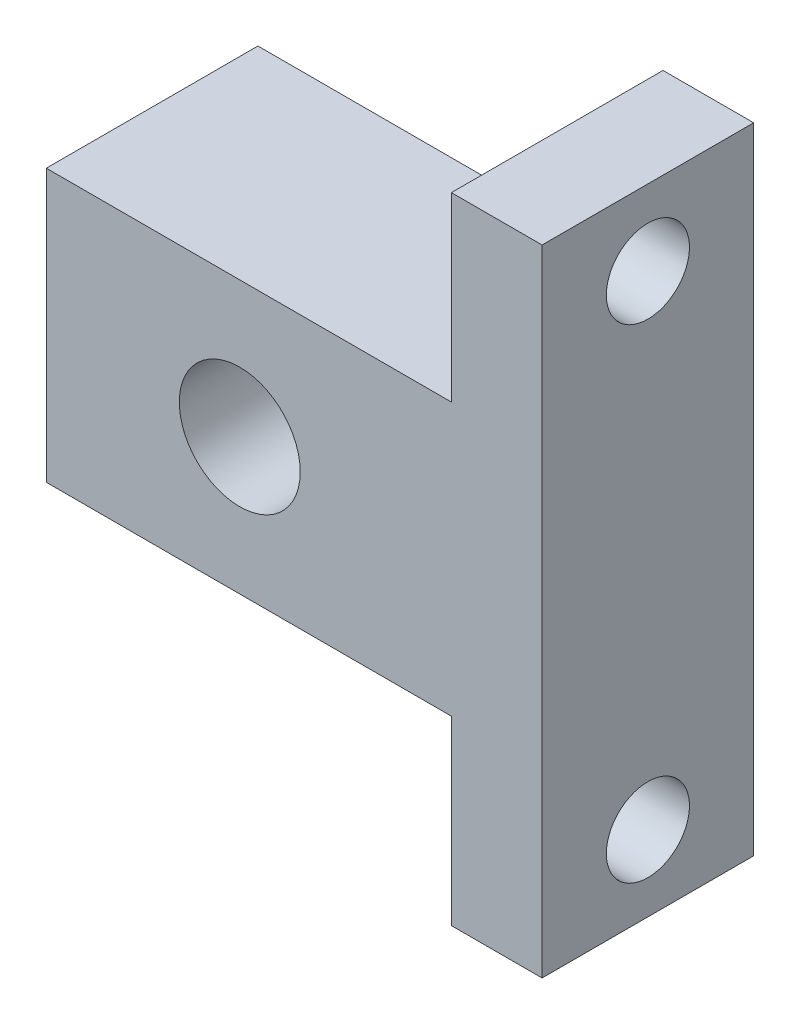
ISO-10303-21;
HEADER;
FILE_DESCRIPTION(('STEP AP214'),'2;1');
FILE_NAME('part.step','',(''),(''),'','','');
FILE_SCHEMA(('AUTOMOTIVE_DESIGN { 1 0 10303 214 1 1 1 1 }'));
ENDSEC;
DATA;
#1=APPLICATION_CONTEXT('core data for automotive mechanical design processes');
#2=APPLICATION_PROTOCOL_DEFINITION('international standard','automotive_design',2000,#1);
#3=PRODUCT_CONTEXT('',#1,'mechanical');
#4=PRODUCT('Part','Part','',(#3));
#5=PRODUCT_RELATED_PRODUCT_CATEGORY('part','',(#4));
#6=PRODUCT_DEFINITION_FORMATION('','',#4);
#7=PRODUCT_DEFINITION_CONTEXT('part definition',#1,'design');
#8=PRODUCT_DEFINITION('design','',#6,#7);
#9=PRODUCT_DEFINITION_SHAPE('','',#8);
#10=(LENGTH_UNIT() NAMED_UNIT(*) SI_UNIT(.MILLI.,.METRE.));
#11=(NAMED_UNIT(*) PLANE_ANGLE_UNIT() SI_UNIT($,.RADIAN.));
#12=(NAMED_UNIT(*) SI_UNIT($,.STERADIAN.) SOLID_ANGLE_UNIT());
#13=UNCERTAINTY_MEASURE_WITH_UNIT(LENGTH_MEASURE(1.E-05),#10,'distance_accuracy_value','');
#14=(GEOMETRIC_REPRESENTATION_CONTEXT(3) GLOBAL_UNCERTAINTY_ASSIGNED_CONTEXT((#13)) GLOBAL_UNIT_ASSIGNED_CONTEXT((#10,
#11,#12)) REPRESENTATION_CONTEXT('',''));
#15=CARTESIAN_POINT('',(0.,0.,0.));
#16=DIRECTION('',(0.,0.,1.));
#17=DIRECTION('',(1.,0.,0.));
#18=AXIS2_PLACEMENT_3D('',#15,#16,#17);
#19=CARTESIAN_POINT('',(20.,-16.0000002384186,7.00000010430813));
#20=DIRECTION('',(-1.,0.,0.));
#21=DIRECTION('',(0.,0.,1.));
#22=AXIS2_PLACEMENT_3D('',#19,#20,#21);
#23=CYLINDRICAL_SURFACE('',#22,2.75);
#24=CARTESIAN_POINT('',(14.0001,-16.0000002384186,7.00000010430813));
#25=DIRECTION('',(-1.,0.,0.));
#26=DIRECTION('',(0.,0.,1.));
#27=AXIS2_PLACEMENT_3D('',#24,#25,#26);
#28=CIRCLE('',#27,2.75);
#29=CARTESIAN_POINT('',(14.0001,-16.0000002384186,9.75000010430813));
#30=VERTEX_POINT('',#29);
#31=EDGE_CURVE('E20',#30,#30,#28,.F.);
#32=ORIENTED_EDGE('',*,*,#31,.F.);
#33=EDGE_LOOP('',(#32));
#34=FACE_BOUND('',#33,.T.);
#35=CARTESIAN_POINT('',(20.,-16.0000002384186,7.00000010430813));
#36=DIRECTION('',(-1.,0.,0.));
#37=DIRECTION('',(0.,0.,1.));
#38=AXIS2_PLACEMENT_3D('',#35,#36,#37);
#39=CIRCLE('',#38,2.75);
#40=CARTESIAN_POINT('',(20.,-16.0000002384186,9.75000010430813));
#41=VERTEX_POINT('',#40);
#42=EDGE_CURVE('E117',#41,#41,#39,.T.);
#43=ORIENTED_EDGE('',*,*,#42,.F.);
#44=EDGE_LOOP('',(#43));
#45=FACE_BOUND('',#44,.T.);
#46=ADVANCED_FACE('F17',(#34,#45),#23,.F.);
#47=CARTESIAN_POINT('',(20.,16.,7.00000010430813));
#48=DIRECTION('',(-1.,0.,0.));
#49=DIRECTION('',(0.,0.,1.));
#50=AXIS2_PLACEMENT_3D('',#47,#48,#49);
#51=CYLINDRICAL_SURFACE('',#50,2.75);
#52=CARTESIAN_POINT('',(14.0000000391155,16.,7.00000010430813));
#53=DIRECTION('',(-1.,0.,0.));
#54=DIRECTION('',(0.,0.,1.));
#55=AXIS2_PLACEMENT_3D('',#52,#53,#54);
#56=CIRCLE('',#55,2.75);
#57=CARTESIAN_POINT('',(14.0000000391155,16.,9.75000010430813));
#58=VERTEX_POINT('',#57);
#59=EDGE_CURVE('E112',#58,#58,#56,.F.);
#60=ORIENTED_EDGE('',*,*,#59,.F.);
#61=EDGE_LOOP('',(#60));
#62=FACE_BOUND('',#61,.T.);
#63=CARTESIAN_POINT('',(20.,16.,7.00000010430813));
#64=DIRECTION('',(-1.,0.,0.));
#65=DIRECTION('',(0.,0.,1.));
#66=AXIS2_PLACEMENT_3D('',#63,#64,#65);
#67=CIRCLE('',#66,2.75);
#68=CARTESIAN_POINT('',(20.,16.,9.75000010430813));
#69=VERTEX_POINT('',#68);
#70=EDGE_CURVE('E120',#69,#69,#67,.T.);
#71=ORIENTED_EDGE('',*,*,#70,.F.);
#72=EDGE_LOOP('',(#71));
#73=FACE_BOUND('',#72,.T.);
#74=ADVANCED_FACE('F149',(#62,#73),#51,.F.);
#75=CARTESIAN_POINT('',(3.6,0.,0.));
#76=DIRECTION('',(0.,0.,1.));
#77=DIRECTION('',(1.,0.,0.));
#78=AXIS2_PLACEMENT_3D('',#75,#76,#77);
#79=PLANE('',#78);
#80=CARTESIAN_POINT('',(0.,0.,0.));
#81=DIRECTION('',(0.,0.,1.));
#82=DIRECTION('',(1.,0.,0.));
#83=AXIS2_PLACEMENT_3D('',#80,#81,#82);
#84=CIRCLE('',#83,4.);
#85=CARTESIAN_POINT('',(4.,0.,0.));
#86=VERTEX_POINT('',#85);
#87=EDGE_CURVE('E108',#86,#86,#84,.T.);
#88=ORIENTED_EDGE('',*,*,#87,.T.);
#89=EDGE_LOOP('',(#88));
#90=FACE_BOUND('',#89,.T.);
#91=DIRECTION('',(1.,0.,0.));
#92=VECTOR('',#91,1.);
#93=CARTESIAN_POINT('',(14.0000002086163,9.,0.));
#94=LINE('',#93,#92);
#95=CARTESIAN_POINT('',(14.0000001043081,9.,0.));
#96=VERTEX_POINT('',#95);
#97=CARTESIAN_POINT('',(-12.8,9.,0.));
#98=VERTEX_POINT('',#97);
#99=EDGE_CURVE('E115',#96,#98,#94,.F.);
#100=ORIENTED_EDGE('',*,*,#99,.F.);
#101=DIRECTION('',(1.73846881335038E-08,-1.,0.));
#102=VECTOR('',#101,1.);
#103=CARTESIAN_POINT('',(14.,21.,0.));
#104=LINE('',#103,#102);
#105=CARTESIAN_POINT('',(14.,21.,0.));
#106=VERTEX_POINT('',#105);
#107=EDGE_CURVE('E185',#106,#96,#104,.T.);
#108=ORIENTED_EDGE('',*,*,#107,.F.);
#109=DIRECTION('',(1.,0.,0.));
#110=VECTOR('',#109,1.);
#111=CARTESIAN_POINT('',(20.,21.,0.));
#112=LINE('',#111,#110);
#113=CARTESIAN_POINT('',(20.,21.,0.));
#114=VERTEX_POINT('',#113);
#115=EDGE_CURVE('E119',#114,#106,#112,.F.);
#116=ORIENTED_EDGE('',*,*,#115,.F.);
#117=DIRECTION('',(0.,1.,0.));
#118=VECTOR('',#117,1.);
#119=CARTESIAN_POINT('',(20.,-21.,0.));
#120=LINE('',#119,#118);
#121=CARTESIAN_POINT('',(20.,-21.,0.));
#122=VERTEX_POINT('',#121);
#123=EDGE_CURVE('E126',#122,#114,#120,.T.);
#124=ORIENTED_EDGE('',*,*,#123,.F.);
#125=DIRECTION('',(1.,0.,0.));
#126=VECTOR('',#125,1.);
#127=CARTESIAN_POINT('',(14.0001,-21.,0.));
#128=LINE('',#127,#126);
#129=CARTESIAN_POINT('',(14.0001,-21.,0.));
#130=VERTEX_POINT('',#129);
#131=EDGE_CURVE('E138',#130,#122,#128,.T.);
#132=ORIENTED_EDGE('',*,*,#131,.F.);
#133=DIRECTION('',(0.,1.,0.));
#134=VECTOR('',#133,1.);
#135=CARTESIAN_POINT('',(14.0001,-9.00000013411045,0.));
#136=LINE('',#135,#134);
#137=CARTESIAN_POINT('',(14.0001,-9.00000006705523,0.));
#138=VERTEX_POINT('',#137);
#139=EDGE_CURVE('E80',#138,#130,#136,.F.);
#140=ORIENTED_EDGE('',*,*,#139,.F.);
#141=DIRECTION('',(1.,-5.00410261613144E-09,0.));
#142=VECTOR('',#141,1.);
#143=CARTESIAN_POINT('',(-12.8,-9.,0.));
#144=LINE('',#143,#142);
#145=CARTESIAN_POINT('',(-12.8,-9.,0.));
#146=VERTEX_POINT('',#145);
#147=EDGE_CURVE('E82',#146,#138,#144,.T.);
#148=ORIENTED_EDGE('',*,*,#147,.F.);
#149=DIRECTION('',(0.,1.,0.));
#150=VECTOR('',#149,1.);
#151=CARTESIAN_POINT('',(-12.8,9.,0.));
#152=LINE('',#151,#150);
#153=EDGE_CURVE('E85',#98,#146,#152,.F.);
#154=ORIENTED_EDGE('',*,*,#153,.F.);
#155=EDGE_LOOP('',(#100,#108,#116,#124,#132,#140,#148,#154));
#156=FACE_BOUND('',#155,.T.);
#157=ADVANCED_FACE('F84',(#90,#156),#79,.F.);
#158=CARTESIAN_POINT('',(-12.8,9.,0.));
#159=DIRECTION('',(-1.,0.,0.));
#160=DIRECTION('',(0.,0.,1.));
#161=AXIS2_PLACEMENT_3D('',#158,#159,#160);
#162=PLANE('',#161);
#163=DIRECTION('',(0.,1.,0.));
#164=VECTOR('',#163,1.);
#165=CARTESIAN_POINT('',(-12.8,0.,14.));
#166=LINE('',#165,#164);
#167=CARTESIAN_POINT('',(-12.8,9.,14.));
#168=VERTEX_POINT('',#167);
#169=CARTESIAN_POINT('',(-12.8,-9.,14.));
#170=VERTEX_POINT('',#169);
#171=EDGE_CURVE('E111',#168,#170,#166,.F.);
#172=ORIENTED_EDGE('',*,*,#171,.F.);
#173=DIRECTION('',(0.,0.,1.));
#174=VECTOR('',#173,1.);
#175=CARTESIAN_POINT('',(-12.8,9.,0.));
#176=LINE('',#175,#174);
#177=EDGE_CURVE('E96',#98,#168,#176,.T.);
#178=ORIENTED_EDGE('',*,*,#177,.F.);
#179=ORIENTED_EDGE('',*,*,#153,.T.);
#180=DIRECTION('',(0.,0.,1.));
#181=VECTOR('',#180,1.);
#182=CARTESIAN_POINT('',(-12.8,-9.,0.));
#183=LINE('',#182,#181);
#184=EDGE_CURVE('E90',#170,#146,#183,.F.);
#185=ORIENTED_EDGE('',*,*,#184,.F.);
#186=EDGE_LOOP('',(#172,#178,#179,#185));
#187=FACE_BOUND('',#186,.T.);
#188=ADVANCED_FACE('F93',(#187),#162,.T.);
#189=CARTESIAN_POINT('',(-12.8,-9.,0.));
#190=DIRECTION('',(-5.00410261613144E-09,-1.,0.));
#191=DIRECTION('',(1.,-5.00410261613144E-09,0.));
#192=AXIS2_PLACEMENT_3D('',#189,#190,#191);
#193=PLANE('',#192);
#194=DIRECTION('',(1.,0.,0.));
#195=VECTOR('',#194,1.);
#196=CARTESIAN_POINT('',(3.6,-9.,14.));
#197=LINE('',#196,#195);
#198=CARTESIAN_POINT('',(14.0001,-9.00000010058284,14.));
#199=VERTEX_POINT('',#198);
#200=EDGE_CURVE('E101',#170,#199,#197,.T.);
#201=ORIENTED_EDGE('',*,*,#200,.F.);
#202=ORIENTED_EDGE('',*,*,#184,.T.);
#203=ORIENTED_EDGE('',*,*,#147,.T.);
#204=DIRECTION('',(0.,0.,1.));
#205=VECTOR('',#204,1.);
#206=CARTESIAN_POINT('',(14.0001,-9.00000013411045,0.));
#207=LINE('',#206,#205);
#208=EDGE_CURVE('E104',#199,#138,#207,.F.);
#209=ORIENTED_EDGE('',*,*,#208,.F.);
#210=EDGE_LOOP('',(#201,#202,#203,#209));
#211=FACE_BOUND('',#210,.T.);
#212=ADVANCED_FACE('F99',(#211),#193,.T.);
#213=CARTESIAN_POINT('',(14.0001,-9.00000013411045,0.));
#214=DIRECTION('',(-1.,0.,0.));
#215=DIRECTION('',(0.,0.,1.));
#216=AXIS2_PLACEMENT_3D('',#213,#214,#215);
#217=PLANE('',#216);
#218=ORIENTED_EDGE('',*,*,#31,.T.);
#219=EDGE_LOOP('',(#218));
#220=FACE_BOUND('',#219,.T.);
#221=DIRECTION('',(0.,1.,0.));
#222=VECTOR('',#221,1.);
#223=CARTESIAN_POINT('',(14.0001,0.,14.));
#224=LINE('',#223,#222);
#225=CARTESIAN_POINT('',(14.0001,-21.,14.));
#226=VERTEX_POINT('',#225);
#227=EDGE_CURVE('E172',#199,#226,#224,.F.);
#228=ORIENTED_EDGE('',*,*,#227,.F.);
#229=ORIENTED_EDGE('',*,*,#208,.T.);
#230=ORIENTED_EDGE('',*,*,#139,.T.);
#231=DIRECTION('',(0.,0.,-1.));
#232=VECTOR('',#231,1.);
#233=CARTESIAN_POINT('',(14.0001,-21.,0.));
#234=LINE('',#233,#232);
#235=EDGE_CURVE('E131',#226,#130,#234,.T.);
#236=ORIENTED_EDGE('',*,*,#235,.F.);
#237=EDGE_LOOP('',(#228,#229,#230,#236));
#238=FACE_BOUND('',#237,.T.);
#239=ADVANCED_FACE('F145',(#220,#238),#217,.T.);
#240=CARTESIAN_POINT('',(14.0001,-21.,0.));
#241=DIRECTION('',(0.,-1.,0.));
#242=DIRECTION('',(0.,0.,-1.));
#243=AXIS2_PLACEMENT_3D('',#240,#241,#242);
#244=PLANE('',#243);
#245=DIRECTION('',(1.,0.,0.));
#246=VECTOR('',#245,1.);
#247=CARTESIAN_POINT('',(3.6,-21.,14.));
#248=LINE('',#247,#246);
#249=CARTESIAN_POINT('',(20.,-21.,14.));
#250=VERTEX_POINT('',#249);
#251=EDGE_CURVE('E166',#226,#250,#248,.T.);
#252=ORIENTED_EDGE('',*,*,#251,.F.);
#253=ORIENTED_EDGE('',*,*,#235,.T.);
#254=ORIENTED_EDGE('',*,*,#131,.T.);
#255=DIRECTION('',(0.,0.,-1.));
#256=VECTOR('',#255,1.);
#257=CARTESIAN_POINT('',(20.,-21.,0.));
#258=LINE('',#257,#256);
#259=EDGE_CURVE('E122',#250,#122,#258,.T.);
#260=ORIENTED_EDGE('',*,*,#259,.F.);
#261=EDGE_LOOP('',(#252,#253,#254,#260));
#262=FACE_BOUND('',#261,.T.);
#263=ADVANCED_FACE('F155',(#262),#244,.T.);
#264=CARTESIAN_POINT('',(20.,-21.,0.));
#265=DIRECTION('',(1.,0.,0.));
#266=DIRECTION('',(0.,0.,-1.));
#267=AXIS2_PLACEMENT_3D('',#264,#265,#266);
#268=PLANE('',#267);
#269=ORIENTED_EDGE('',*,*,#42,.T.);
#270=EDGE_LOOP('',(#269));
#271=FACE_BOUND('',#270,.T.);
#272=ORIENTED_EDGE('',*,*,#70,.T.);
#273=EDGE_LOOP('',(#272));
#274=FACE_BOUND('',#273,.T.);
#275=DIRECTION('',(0.,1.,0.));
#276=VECTOR('',#275,1.);
#277=CARTESIAN_POINT('',(20.,0.,14.));
#278=LINE('',#277,#276);
#279=CARTESIAN_POINT('',(20.,21.,14.));
#280=VERTEX_POINT('',#279);
#281=EDGE_CURVE('E158',#250,#280,#278,.T.);
#282=ORIENTED_EDGE('',*,*,#281,.F.);
#283=ORIENTED_EDGE('',*,*,#259,.T.);
#284=ORIENTED_EDGE('',*,*,#123,.T.);
#285=DIRECTION('',(0.,0.,1.));
#286=VECTOR('',#285,1.);
#287=CARTESIAN_POINT('',(20.,21.,0.));
#288=LINE('',#287,#286);
#289=EDGE_CURVE('E161',#280,#114,#288,.F.);
#290=ORIENTED_EDGE('',*,*,#289,.F.);
#291=EDGE_LOOP('',(#282,#283,#284,#290));
#292=FACE_BOUND('',#291,.T.);
#293=ADVANCED_FACE('F152',(#271,#274,#292),#268,.T.);
#294=CARTESIAN_POINT('',(20.,21.,0.));
#295=DIRECTION('',(0.,1.,0.));
#296=DIRECTION('',(0.,0.,1.));
#297=AXIS2_PLACEMENT_3D('',#294,#295,#296);
#298=PLANE('',#297);
#299=DIRECTION('',(1.,0.,0.));
#300=VECTOR('',#299,1.);
#301=CARTESIAN_POINT('',(3.6,21.,14.));
#302=LINE('',#301,#300);
#303=CARTESIAN_POINT('',(14.,21.,14.));
#304=VERTEX_POINT('',#303);
#305=EDGE_CURVE('E165',#280,#304,#302,.F.);
#306=ORIENTED_EDGE('',*,*,#305,.F.);
#307=ORIENTED_EDGE('',*,*,#289,.T.);
#308=ORIENTED_EDGE('',*,*,#115,.T.);
#309=DIRECTION('',(0.,0.,1.));
#310=VECTOR('',#309,1.);
#311=CARTESIAN_POINT('',(14.,21.,0.));
#312=LINE('',#311,#310);
#313=EDGE_CURVE('E116',#304,#106,#312,.F.);
#314=ORIENTED_EDGE('',*,*,#313,.F.);
#315=EDGE_LOOP('',(#306,#307,#308,#314));
#316=FACE_BOUND('',#315,.T.);
#317=ADVANCED_FACE('F154',(#316),#298,.T.);
#318=CARTESIAN_POINT('',(14.,21.,0.));
#319=DIRECTION('',(-1.,-1.73846881335038E-08,0.));
#320=DIRECTION('',(1.73846881335038E-08,-1.,0.));
#321=AXIS2_PLACEMENT_3D('',#318,#319,#320);
#322=PLANE('',#321);
#323=ORIENTED_EDGE('',*,*,#59,.T.);
#324=EDGE_LOOP('',(#323));
#325=FACE_BOUND('',#324,.T.);
#326=DIRECTION('',(0.,1.,0.));
#327=VECTOR('',#326,1.);
#328=CARTESIAN_POINT('',(14.,0.,14.));
#329=LINE('',#328,#327);
#330=CARTESIAN_POINT('',(14.0000001564622,9.,14.));
#331=VERTEX_POINT('',#330);
#332=EDGE_CURVE('E189',#304,#331,#329,.F.);
#333=ORIENTED_EDGE('',*,*,#332,.F.);
#334=ORIENTED_EDGE('',*,*,#313,.T.);
#335=ORIENTED_EDGE('',*,*,#107,.T.);
#336=DIRECTION('',(0.,0.,1.));
#337=VECTOR('',#336,1.);
#338=CARTESIAN_POINT('',(14.0000002086163,9.,0.));
#339=LINE('',#338,#337);
#340=EDGE_CURVE('E35',#331,#96,#339,.F.);
#341=ORIENTED_EDGE('',*,*,#340,.F.);
#342=EDGE_LOOP('',(#333,#334,#335,#341));
#343=FACE_BOUND('',#342,.T.);
#344=ADVANCED_FACE('F188',(#325,#343),#322,.T.);
#345=CARTESIAN_POINT('',(14.0000002086163,9.,0.));
#346=DIRECTION('',(0.,1.,0.));
#347=DIRECTION('',(0.,0.,1.));
#348=AXIS2_PLACEMENT_3D('',#345,#346,#347);
#349=PLANE('',#348);
#350=DIRECTION('',(1.,0.,0.));
#351=VECTOR('',#350,1.);
#352=CARTESIAN_POINT('',(3.6,9.,14.));
#353=LINE('',#352,#351);
#354=EDGE_CURVE('E26',#331,#168,#353,.F.);
#355=ORIENTED_EDGE('',*,*,#354,.F.);
#356=ORIENTED_EDGE('',*,*,#340,.T.);
#357=ORIENTED_EDGE('',*,*,#99,.T.);
#358=ORIENTED_EDGE('',*,*,#177,.T.);
#359=EDGE_LOOP('',(#355,#356,#357,#358));
#360=FACE_BOUND('',#359,.T.);
#361=ADVANCED_FACE('F194',(#360),#349,.T.);
#362=CARTESIAN_POINT('',(0.,0.,0.));
#363=DIRECTION('',(0.,0.,1.));
#364=DIRECTION('',(1.,0.,0.));
#365=AXIS2_PLACEMENT_3D('',#362,#363,#364);
#366=CYLINDRICAL_SURFACE('',#365,4.);
#367=ORIENTED_EDGE('',*,*,#87,.F.);
#368=EDGE_LOOP('',(#367));
#369=FACE_BOUND('',#368,.T.);
#370=CARTESIAN_POINT('',(0.,0.,14.));
#371=DIRECTION('',(0.,0.,1.));
#372=DIRECTION('',(1.,0.,0.));
#373=AXIS2_PLACEMENT_3D('',#370,#371,#372);
#374=CIRCLE('',#373,4.);
#375=CARTESIAN_POINT('',(4.,0.,14.));
#376=VERTEX_POINT('',#375);
#377=EDGE_CURVE('E11',#376,#376,#374,.F.);
#378=ORIENTED_EDGE('',*,*,#377,.F.);
#379=EDGE_LOOP('',(#378));
#380=FACE_BOUND('',#379,.T.);
#381=ADVANCED_FACE('F196',(#369,#380),#366,.F.);
#382=CARTESIAN_POINT('',(3.6,0.,14.));
#383=DIRECTION('',(0.,0.,1.));
#384=DIRECTION('',(1.,0.,0.));
#385=AXIS2_PLACEMENT_3D('',#382,#383,#384);
#386=PLANE('',#385);
#387=ORIENTED_EDGE('',*,*,#377,.T.);
#388=EDGE_LOOP('',(#387));
#389=FACE_BOUND('',#388,.T.);
#390=ORIENTED_EDGE('',*,*,#332,.T.);
#391=ORIENTED_EDGE('',*,*,#354,.T.);
#392=ORIENTED_EDGE('',*,*,#171,.T.);
#393=ORIENTED_EDGE('',*,*,#200,.T.);
#394=ORIENTED_EDGE('',*,*,#227,.T.);
#395=ORIENTED_EDGE('',*,*,#251,.T.);
#396=ORIENTED_EDGE('',*,*,#281,.T.);
#397=ORIENTED_EDGE('',*,*,#305,.T.);
#398=EDGE_LOOP('',(#390,#391,#392,#393,#394,#395,#396,#397));
#399=FACE_BOUND('',#398,.T.);
#400=ADVANCED_FACE('F171',(#389,#399),#386,.T.);
#401=CLOSED_SHELL('',(#46,#74,#157,#188,#212,#239,#263,#293,#317,#344,#361,#381,#400));
#402=MANIFOLD_SOLID_BREP('B1',#401);
#403=ADVANCED_BREP_SHAPE_REPRESENTATION('',(#18,#402),#14);
#404=SHAPE_DEFINITION_REPRESENTATION(#9,#403);
ENDSEC;
END-ISO-10303-21;
